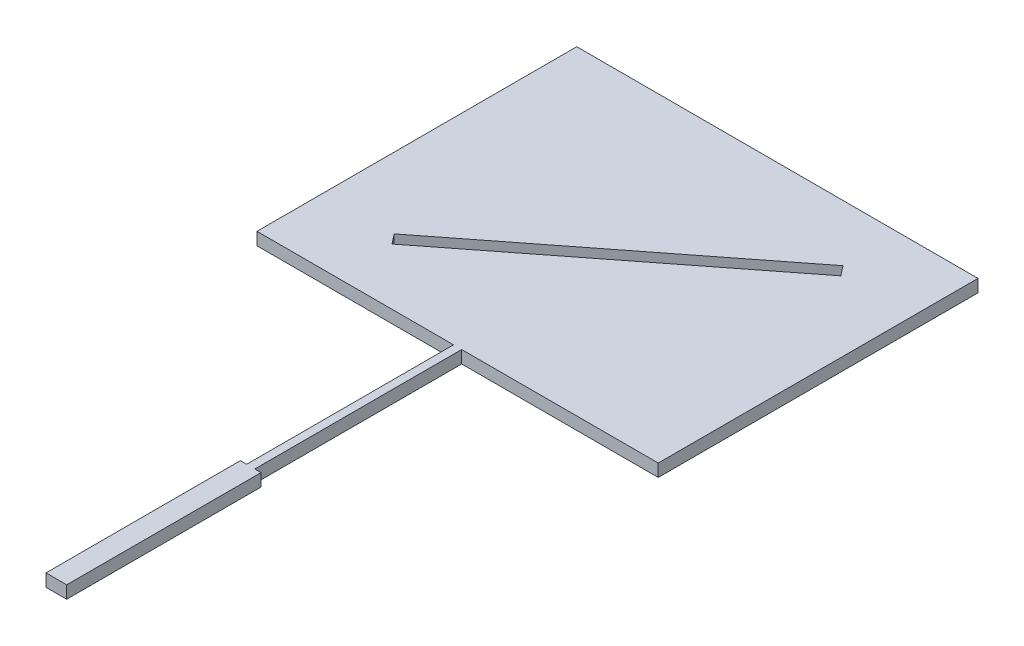
ISO-10303-21;
HEADER;
FILE_DESCRIPTION(('STEP AP214'),'2;1');
FILE_NAME('part.step','',(''),(''),'','','');
FILE_SCHEMA(('AUTOMOTIVE_DESIGN { 1 0 10303 214 1 1 1 1 }'));
ENDSEC;
DATA;
#1=APPLICATION_CONTEXT('core data for automotive mechanical design processes');
#2=APPLICATION_PROTOCOL_DEFINITION('international standard','automotive_design',2000,#1);
#3=PRODUCT_CONTEXT('',#1,'mechanical');
#4=PRODUCT('Part','Part','',(#3));
#5=PRODUCT_RELATED_PRODUCT_CATEGORY('part','',(#4));
#6=PRODUCT_DEFINITION_FORMATION('','',#4);
#7=PRODUCT_DEFINITION_CONTEXT('part definition',#1,'design');
#8=PRODUCT_DEFINITION('design','',#6,#7);
#9=PRODUCT_DEFINITION_SHAPE('','',#8);
#10=(LENGTH_UNIT() NAMED_UNIT(*) SI_UNIT(.MILLI.,.METRE.));
#11=(NAMED_UNIT(*) PLANE_ANGLE_UNIT() SI_UNIT($,.RADIAN.));
#12=(NAMED_UNIT(*) SI_UNIT($,.STERADIAN.) SOLID_ANGLE_UNIT());
#13=UNCERTAINTY_MEASURE_WITH_UNIT(LENGTH_MEASURE(1.E-05),#10,'distance_accuracy_value','');
#14=(GEOMETRIC_REPRESENTATION_CONTEXT(3) GLOBAL_UNCERTAINTY_ASSIGNED_CONTEXT((#13)) GLOBAL_UNIT_ASSIGNED_CONTEXT((#10,
#11,#12)) REPRESENTATION_CONTEXT('',''));
#15=CARTESIAN_POINT('',(0.,0.,0.));
#16=DIRECTION('',(0.,0.,1.));
#17=DIRECTION('',(1.,0.,0.));
#18=AXIS2_PLACEMENT_3D('',#15,#16,#17);
#19=CARTESIAN_POINT('',(0.,2.,-31.));
#20=DIRECTION('',(1.,0.,0.));
#21=DIRECTION('',(0.,0.,-1.));
#22=AXIS2_PLACEMENT_3D('',#19,#20,#21);
#23=PLANE('',#22);
#24=DIRECTION('',(0.,0.,1.));
#25=VECTOR('',#24,1.);
#26=CARTESIAN_POINT('',(0.,0.,-31.));
#27=LINE('',#26,#25);
#28=CARTESIAN_POINT('',(0.,0.,-31.));
#29=VERTEX_POINT('',#28);
#30=CARTESIAN_POINT('',(0.,0.,0.));
#31=VERTEX_POINT('',#30);
#32=EDGE_CURVE('E182',#29,#31,#27,.T.);
#33=ORIENTED_EDGE('',*,*,#32,.T.);
#34=DIRECTION('',(0.,-1.,0.));
#35=VECTOR('',#34,1.);
#36=CARTESIAN_POINT('',(0.,2.,0.));
#37=LINE('',#36,#35);
#38=CARTESIAN_POINT('',(0.,2.,0.));
#39=VERTEX_POINT('',#38);
#40=EDGE_CURVE('E11',#39,#31,#37,.T.);
#41=ORIENTED_EDGE('',*,*,#40,.F.);
#42=DIRECTION('',(0.,0.,1.));
#43=VECTOR('',#42,1.);
#44=CARTESIAN_POINT('',(0.,2.,-31.));
#45=LINE('',#44,#43);
#46=CARTESIAN_POINT('',(0.,2.,-31.));
#47=VERTEX_POINT('',#46);
#48=EDGE_CURVE('E186',#47,#39,#45,.T.);
#49=ORIENTED_EDGE('',*,*,#48,.F.);
#50=DIRECTION('',(0.,-1.,0.));
#51=VECTOR('',#50,1.);
#52=CARTESIAN_POINT('',(0.,2.,-31.));
#53=LINE('',#52,#51);
#54=EDGE_CURVE('E212',#47,#29,#53,.T.);
#55=ORIENTED_EDGE('',*,*,#54,.T.);
#56=EDGE_LOOP('',(#33,#41,#49,#55));
#57=FACE_BOUND('',#56,.T.);
#58=ADVANCED_FACE('F37',(#57),#23,.F.);
#59=CARTESIAN_POINT('',(0.,2.,0.));
#60=DIRECTION('',(0.,0.,-1.));
#61=DIRECTION('',(-1.,0.,0.));
#62=AXIS2_PLACEMENT_3D('',#59,#60,#61);
#63=PLANE('',#62);
#64=DIRECTION('',(1.,0.,0.));
#65=VECTOR('',#64,1.);
#66=CARTESIAN_POINT('',(0.,0.,0.));
#67=LINE('',#66,#65);
#68=CARTESIAN_POINT('',(3.3,0.,0.));
#69=VERTEX_POINT('',#68);
#70=EDGE_CURVE('E215',#31,#69,#67,.T.);
#71=ORIENTED_EDGE('',*,*,#70,.T.);
#72=DIRECTION('',(0.,-1.,0.));
#73=VECTOR('',#72,1.);
#74=CARTESIAN_POINT('',(3.3,2.,0.));
#75=LINE('',#74,#73);
#76=CARTESIAN_POINT('',(3.3,2.,0.));
#77=VERTEX_POINT('',#76);
#78=EDGE_CURVE('E44',#77,#69,#75,.T.);
#79=ORIENTED_EDGE('',*,*,#78,.F.);
#80=DIRECTION('',(1.,0.,0.));
#81=VECTOR('',#80,1.);
#82=CARTESIAN_POINT('',(0.,2.,0.));
#83=LINE('',#82,#81);
#84=EDGE_CURVE('E189',#39,#77,#83,.T.);
#85=ORIENTED_EDGE('',*,*,#84,.F.);
#86=ORIENTED_EDGE('',*,*,#40,.T.);
#87=EDGE_LOOP('',(#71,#79,#85,#86));
#88=FACE_BOUND('',#87,.T.);
#89=ADVANCED_FACE('F290',(#88),#63,.F.);
#90=CARTESIAN_POINT('',(3.3,2.,0.));
#91=DIRECTION('',(-1.,0.,0.));
#92=DIRECTION('',(0.,0.,1.));
#93=AXIS2_PLACEMENT_3D('',#90,#91,#92);
#94=PLANE('',#93);
#95=DIRECTION('',(0.,0.,-1.));
#96=VECTOR('',#95,1.);
#97=CARTESIAN_POINT('',(3.3,0.,0.));
#98=LINE('',#97,#96);
#99=CARTESIAN_POINT('',(3.3,0.,-31.));
#100=VERTEX_POINT('',#99);
#101=EDGE_CURVE('E217',#69,#100,#98,.T.);
#102=ORIENTED_EDGE('',*,*,#101,.T.);
#103=DIRECTION('',(0.,-1.,0.));
#104=VECTOR('',#103,1.);
#105=CARTESIAN_POINT('',(3.3,2.,-31.));
#106=LINE('',#105,#104);
#107=CARTESIAN_POINT('',(3.3,2.,-31.));
#108=VERTEX_POINT('',#107);
#109=EDGE_CURVE('E262',#108,#100,#106,.T.);
#110=ORIENTED_EDGE('',*,*,#109,.F.);
#111=DIRECTION('',(0.,0.,-1.));
#112=VECTOR('',#111,1.);
#113=CARTESIAN_POINT('',(3.3,2.,0.));
#114=LINE('',#113,#112);
#115=EDGE_CURVE('E192',#77,#108,#114,.T.);
#116=ORIENTED_EDGE('',*,*,#115,.F.);
#117=ORIENTED_EDGE('',*,*,#78,.T.);
#118=EDGE_LOOP('',(#102,#110,#116,#117));
#119=FACE_BOUND('',#118,.T.);
#120=ADVANCED_FACE('F269',(#119),#94,.F.);
#121=CARTESIAN_POINT('',(3.3,2.,-31.));
#122=DIRECTION('',(0.,0.,1.));
#123=DIRECTION('',(1.,0.,0.));
#124=AXIS2_PLACEMENT_3D('',#121,#122,#123);
#125=PLANE('',#124);
#126=DIRECTION('',(-1.,0.,0.));
#127=VECTOR('',#126,1.);
#128=CARTESIAN_POINT('',(3.3,0.,-31.));
#129=LINE('',#128,#127);
#130=CARTESIAN_POINT('',(2.3,0.,-31.));
#131=VERTEX_POINT('',#130);
#132=EDGE_CURVE('E219',#100,#131,#129,.T.);
#133=ORIENTED_EDGE('',*,*,#132,.T.);
#134=DIRECTION('',(0.,-1.,0.));
#135=VECTOR('',#134,1.);
#136=CARTESIAN_POINT('',(2.3,2.,-31.));
#137=LINE('',#136,#135);
#138=CARTESIAN_POINT('',(2.3,2.,-31.));
#139=VERTEX_POINT('',#138);
#140=EDGE_CURVE('E259',#139,#131,#137,.T.);
#141=ORIENTED_EDGE('',*,*,#140,.F.);
#142=DIRECTION('',(-1.,0.,0.));
#143=VECTOR('',#142,1.);
#144=CARTESIAN_POINT('',(3.3,2.,-31.));
#145=LINE('',#144,#143);
#146=EDGE_CURVE('E194',#108,#139,#145,.T.);
#147=ORIENTED_EDGE('',*,*,#146,.F.);
#148=ORIENTED_EDGE('',*,*,#109,.T.);
#149=EDGE_LOOP('',(#133,#141,#147,#148));
#150=FACE_BOUND('',#149,.T.);
#151=ADVANCED_FACE('F278',(#150),#125,.F.);
#152=CARTESIAN_POINT('',(2.3,2.,-31.));
#153=DIRECTION('',(-1.,0.,0.));
#154=DIRECTION('',(0.,0.,1.));
#155=AXIS2_PLACEMENT_3D('',#152,#153,#154);
#156=PLANE('',#155);
#157=DIRECTION('',(0.,0.,-1.));
#158=VECTOR('',#157,1.);
#159=CARTESIAN_POINT('',(2.3,0.,-31.));
#160=LINE('',#159,#158);
#161=CARTESIAN_POINT('',(2.3,0.,-64.));
#162=VERTEX_POINT('',#161);
#163=EDGE_CURVE('E221',#131,#162,#160,.T.);
#164=ORIENTED_EDGE('',*,*,#163,.T.);
#165=DIRECTION('',(0.,-1.,0.));
#166=VECTOR('',#165,1.);
#167=CARTESIAN_POINT('',(2.3,2.,-64.));
#168=LINE('',#167,#166);
#169=CARTESIAN_POINT('',(2.3,2.,-64.));
#170=VERTEX_POINT('',#169);
#171=EDGE_CURVE('E256',#170,#162,#168,.T.);
#172=ORIENTED_EDGE('',*,*,#171,.F.);
#173=DIRECTION('',(0.,0.,-1.));
#174=VECTOR('',#173,1.);
#175=CARTESIAN_POINT('',(2.3,2.,-31.));
#176=LINE('',#175,#174);
#177=EDGE_CURVE('E196',#139,#170,#176,.T.);
#178=ORIENTED_EDGE('',*,*,#177,.F.);
#179=ORIENTED_EDGE('',*,*,#140,.T.);
#180=EDGE_LOOP('',(#164,#172,#178,#179));
#181=FACE_BOUND('',#180,.T.);
#182=ADVANCED_FACE('F282',(#181),#156,.F.);
#183=CARTESIAN_POINT('',(2.3,2.,-64.));
#184=DIRECTION('',(0.,0.,-1.));
#185=DIRECTION('',(-1.,0.,0.));
#186=AXIS2_PLACEMENT_3D('',#183,#184,#185);
#187=PLANE('',#186);
#188=DIRECTION('',(1.,0.,0.));
#189=VECTOR('',#188,1.);
#190=CARTESIAN_POINT('',(2.3,0.,-64.));
#191=LINE('',#190,#189);
#192=CARTESIAN_POINT('',(33.65,0.,-64.));
#193=VERTEX_POINT('',#192);
#194=EDGE_CURVE('E223',#162,#193,#191,.T.);
#195=ORIENTED_EDGE('',*,*,#194,.T.);
#196=DIRECTION('',(0.,-1.,0.));
#197=VECTOR('',#196,1.);
#198=CARTESIAN_POINT('',(33.65,2.,-64.));
#199=LINE('',#198,#197);
#200=CARTESIAN_POINT('',(33.65,2.,-64.));
#201=VERTEX_POINT('',#200);
#202=EDGE_CURVE('E253',#201,#193,#199,.T.);
#203=ORIENTED_EDGE('',*,*,#202,.F.);
#204=DIRECTION('',(1.,0.,0.));
#205=VECTOR('',#204,1.);
#206=CARTESIAN_POINT('',(2.3,2.,-64.));
#207=LINE('',#206,#205);
#208=EDGE_CURVE('E198',#170,#201,#207,.T.);
#209=ORIENTED_EDGE('',*,*,#208,.F.);
#210=ORIENTED_EDGE('',*,*,#171,.T.);
#211=EDGE_LOOP('',(#195,#203,#209,#210));
#212=FACE_BOUND('',#211,.T.);
#213=ADVANCED_FACE('F323',(#212),#187,.F.);
#214=CARTESIAN_POINT('',(33.65,2.,-64.));
#215=DIRECTION('',(-1.,0.,0.));
#216=DIRECTION('',(0.,0.,1.));
#217=AXIS2_PLACEMENT_3D('',#214,#215,#216);
#218=PLANE('',#217);
#219=DIRECTION('',(0.,0.,-1.));
#220=VECTOR('',#219,1.);
#221=CARTESIAN_POINT('',(33.65,0.,-64.));
#222=LINE('',#221,#220);
#223=CARTESIAN_POINT('',(33.65,0.,-115.));
#224=VERTEX_POINT('',#223);
#225=EDGE_CURVE('E225',#193,#224,#222,.T.);
#226=ORIENTED_EDGE('',*,*,#225,.T.);
#227=DIRECTION('',(0.,-1.,0.));
#228=VECTOR('',#227,1.);
#229=CARTESIAN_POINT('',(33.65,2.,-115.));
#230=LINE('',#229,#228);
#231=CARTESIAN_POINT('',(33.65,2.,-115.));
#232=VERTEX_POINT('',#231);
#233=EDGE_CURVE('E250',#232,#224,#230,.T.);
#234=ORIENTED_EDGE('',*,*,#233,.F.);
#235=DIRECTION('',(0.,0.,-1.));
#236=VECTOR('',#235,1.);
#237=CARTESIAN_POINT('',(33.65,2.,-64.));
#238=LINE('',#237,#236);
#239=EDGE_CURVE('E200',#201,#232,#238,.T.);
#240=ORIENTED_EDGE('',*,*,#239,.F.);
#241=ORIENTED_EDGE('',*,*,#202,.T.);
#242=EDGE_LOOP('',(#226,#234,#240,#241));
#243=FACE_BOUND('',#242,.T.);
#244=ADVANCED_FACE('F321',(#243),#218,.F.);
#245=CARTESIAN_POINT('',(33.65,2.,-115.));
#246=DIRECTION('',(0.,0.,1.));
#247=DIRECTION('',(1.,0.,0.));
#248=AXIS2_PLACEMENT_3D('',#245,#246,#247);
#249=PLANE('',#248);
#250=DIRECTION('',(-1.,0.,0.));
#251=VECTOR('',#250,1.);
#252=CARTESIAN_POINT('',(33.65,0.,-115.));
#253=LINE('',#252,#251);
#254=CARTESIAN_POINT('',(-30.35,0.,-115.));
#255=VERTEX_POINT('',#254);
#256=EDGE_CURVE('E227',#224,#255,#253,.T.);
#257=ORIENTED_EDGE('',*,*,#256,.T.);
#258=DIRECTION('',(0.,-1.,0.));
#259=VECTOR('',#258,1.);
#260=CARTESIAN_POINT('',(-30.35,2.,-115.));
#261=LINE('',#260,#259);
#262=CARTESIAN_POINT('',(-30.35,2.,-115.));
#263=VERTEX_POINT('',#262);
#264=EDGE_CURVE('E247',#263,#255,#261,.T.);
#265=ORIENTED_EDGE('',*,*,#264,.F.);
#266=DIRECTION('',(-1.,0.,0.));
#267=VECTOR('',#266,1.);
#268=CARTESIAN_POINT('',(33.65,2.,-115.));
#269=LINE('',#268,#267);
#270=EDGE_CURVE('E202',#232,#263,#269,.T.);
#271=ORIENTED_EDGE('',*,*,#270,.F.);
#272=ORIENTED_EDGE('',*,*,#233,.T.);
#273=EDGE_LOOP('',(#257,#265,#271,#272));
#274=FACE_BOUND('',#273,.T.);
#275=ADVANCED_FACE('F317',(#274),#249,.F.);
#276=CARTESIAN_POINT('',(-30.35,2.,-115.));
#277=DIRECTION('',(1.,0.,0.));
#278=DIRECTION('',(0.,0.,-1.));
#279=AXIS2_PLACEMENT_3D('',#276,#277,#278);
#280=PLANE('',#279);
#281=DIRECTION('',(0.,0.,1.));
#282=VECTOR('',#281,1.);
#283=CARTESIAN_POINT('',(-30.35,0.,-115.));
#284=LINE('',#283,#282);
#285=CARTESIAN_POINT('',(-30.35,0.,-64.));
#286=VERTEX_POINT('',#285);
#287=EDGE_CURVE('E229',#255,#286,#284,.T.);
#288=ORIENTED_EDGE('',*,*,#287,.T.);
#289=DIRECTION('',(0.,-1.,0.));
#290=VECTOR('',#289,1.);
#291=CARTESIAN_POINT('',(-30.35,2.,-64.));
#292=LINE('',#291,#290);
#293=CARTESIAN_POINT('',(-30.35,2.,-64.));
#294=VERTEX_POINT('',#293);
#295=EDGE_CURVE('E244',#294,#286,#292,.T.);
#296=ORIENTED_EDGE('',*,*,#295,.F.);
#297=DIRECTION('',(0.,0.,1.));
#298=VECTOR('',#297,1.);
#299=CARTESIAN_POINT('',(-30.35,2.,-115.));
#300=LINE('',#299,#298);
#301=EDGE_CURVE('E204',#263,#294,#300,.T.);
#302=ORIENTED_EDGE('',*,*,#301,.F.);
#303=ORIENTED_EDGE('',*,*,#264,.T.);
#304=EDGE_LOOP('',(#288,#296,#302,#303));
#305=FACE_BOUND('',#304,.T.);
#306=ADVANCED_FACE('F312',(#305),#280,.F.);
#307=CARTESIAN_POINT('',(-30.35,2.,-64.));
#308=DIRECTION('',(0.,0.,-1.));
#309=DIRECTION('',(-1.,0.,0.));
#310=AXIS2_PLACEMENT_3D('',#307,#308,#309);
#311=PLANE('',#310);
#312=DIRECTION('',(1.,0.,0.));
#313=VECTOR('',#312,1.);
#314=CARTESIAN_POINT('',(-30.35,0.,-64.));
#315=LINE('',#314,#313);
#316=CARTESIAN_POINT('',(1.,0.,-64.));
#317=VERTEX_POINT('',#316);
#318=EDGE_CURVE('E231',#286,#317,#315,.T.);
#319=ORIENTED_EDGE('',*,*,#318,.T.);
#320=DIRECTION('',(0.,-1.,0.));
#321=VECTOR('',#320,1.);
#322=CARTESIAN_POINT('',(1.,2.,-64.));
#323=LINE('',#322,#321);
#324=CARTESIAN_POINT('',(1.,2.,-64.));
#325=VERTEX_POINT('',#324);
#326=EDGE_CURVE('E241',#325,#317,#323,.T.);
#327=ORIENTED_EDGE('',*,*,#326,.F.);
#328=DIRECTION('',(1.,0.,0.));
#329=VECTOR('',#328,1.);
#330=CARTESIAN_POINT('',(-30.35,2.,-64.));
#331=LINE('',#330,#329);
#332=EDGE_CURVE('E206',#294,#325,#331,.T.);
#333=ORIENTED_EDGE('',*,*,#332,.F.);
#334=ORIENTED_EDGE('',*,*,#295,.T.);
#335=EDGE_LOOP('',(#319,#327,#333,#334));
#336=FACE_BOUND('',#335,.T.);
#337=ADVANCED_FACE('F306',(#336),#311,.F.);
#338=CARTESIAN_POINT('',(1.,2.,-64.));
#339=DIRECTION('',(1.,0.,0.));
#340=DIRECTION('',(0.,0.,-1.));
#341=AXIS2_PLACEMENT_3D('',#338,#339,#340);
#342=PLANE('',#341);
#343=DIRECTION('',(0.,0.,1.));
#344=VECTOR('',#343,1.);
#345=CARTESIAN_POINT('',(1.,0.,-64.));
#346=LINE('',#345,#344);
#347=CARTESIAN_POINT('',(1.,0.,-31.));
#348=VERTEX_POINT('',#347);
#349=EDGE_CURVE('E233',#317,#348,#346,.T.);
#350=ORIENTED_EDGE('',*,*,#349,.T.);
#351=DIRECTION('',(0.,-1.,0.));
#352=VECTOR('',#351,1.);
#353=CARTESIAN_POINT('',(1.,2.,-31.));
#354=LINE('',#353,#352);
#355=CARTESIAN_POINT('',(1.,2.,-31.));
#356=VERTEX_POINT('',#355);
#357=EDGE_CURVE('E238',#356,#348,#354,.T.);
#358=ORIENTED_EDGE('',*,*,#357,.F.);
#359=DIRECTION('',(0.,0.,1.));
#360=VECTOR('',#359,1.);
#361=CARTESIAN_POINT('',(1.,2.,-64.));
#362=LINE('',#361,#360);
#363=EDGE_CURVE('E208',#325,#356,#362,.T.);
#364=ORIENTED_EDGE('',*,*,#363,.F.);
#365=ORIENTED_EDGE('',*,*,#326,.T.);
#366=EDGE_LOOP('',(#350,#358,#364,#365));
#367=FACE_BOUND('',#366,.T.);
#368=ADVANCED_FACE('F302',(#367),#342,.F.);
#369=CARTESIAN_POINT('',(1.,2.,-31.));
#370=DIRECTION('',(0.,0.,1.));
#371=DIRECTION('',(1.,0.,0.));
#372=AXIS2_PLACEMENT_3D('',#369,#370,#371);
#373=PLANE('',#372);
#374=DIRECTION('',(-1.,0.,0.));
#375=VECTOR('',#374,1.);
#376=CARTESIAN_POINT('',(1.,0.,-31.));
#377=LINE('',#376,#375);
#378=EDGE_CURVE('E190',#348,#29,#377,.T.);
#379=ORIENTED_EDGE('',*,*,#378,.T.);
#380=ORIENTED_EDGE('',*,*,#54,.F.);
#381=DIRECTION('',(-1.,0.,0.));
#382=VECTOR('',#381,1.);
#383=CARTESIAN_POINT('',(1.,2.,-31.));
#384=LINE('',#383,#382);
#385=EDGE_CURVE('E210',#356,#47,#384,.T.);
#386=ORIENTED_EDGE('',*,*,#385,.F.);
#387=ORIENTED_EDGE('',*,*,#357,.T.);
#388=EDGE_LOOP('',(#379,#380,#386,#387));
#389=FACE_BOUND('',#388,.T.);
#390=ADVANCED_FACE('F297',(#389),#373,.F.);
#391=CARTESIAN_POINT('',(0.,2.,0.));
#392=DIRECTION('',(0.,1.,0.));
#393=DIRECTION('',(0.,0.,1.));
#394=AXIS2_PLACEMENT_3D('',#391,#392,#393);
#395=PLANE('',#394);
#396=DIRECTION('',(-0.615661475325648,0.,-0.78801075360673));
#397=VECTOR('',#396,1.);
#398=CARTESIAN_POINT('',(21.7442742169714,2.,-105.199367620804));
#399=LINE('',#398,#397);
#400=CARTESIAN_POINT('',(22.3599356922971,2.,-104.411356867198));
#401=VERTEX_POINT('',#400);
#402=CARTESIAN_POINT('',(21.1286127416458,2.,-105.987378374411));
#403=VERTEX_POINT('',#402);
#404=EDGE_CURVE('E153',#401,#403,#399,.T.);
#405=ORIENTED_EDGE('',*,*,#404,.F.);
#406=DIRECTION('',(0.788010753606721,0.,-0.615661475325659));
#407=VECTOR('',#406,1.);
#408=CARTESIAN_POINT('',(22.3599356922971,2.,-104.411356867198));
#409=LINE('',#408,#407);
#410=CARTESIAN_POINT('',(-17.8286127416457,2.,-73.012621625589));
#411=VERTEX_POINT('',#410);
#412=EDGE_CURVE('E168',#411,#401,#409,.T.);
#413=ORIENTED_EDGE('',*,*,#412,.F.);
#414=DIRECTION('',(0.615661475325667,0.,0.788010753606716));
#415=VECTOR('',#414,1.);
#416=CARTESIAN_POINT('',(-17.8286127416457,2.,-73.012621625589));
#417=LINE('',#416,#415);
#418=CARTESIAN_POINT('',(-19.059935692297,2.,-74.5886431328024));
#419=VERTEX_POINT('',#418);
#420=EDGE_CURVE('E175',#419,#411,#417,.T.);
#421=ORIENTED_EDGE('',*,*,#420,.F.);
#422=DIRECTION('',(-0.788010753606721,0.,0.61566147532566));
#423=VECTOR('',#422,1.);
#424=CARTESIAN_POINT('',(-19.059935692297,2.,-74.5886431328024));
#425=LINE('',#424,#423);
#426=EDGE_CURVE('E173',#403,#419,#425,.T.);
#427=ORIENTED_EDGE('',*,*,#426,.F.);
#428=EDGE_LOOP('',(#405,#413,#421,#427));
#429=FACE_BOUND('',#428,.T.);
#430=ORIENTED_EDGE('',*,*,#48,.T.);
#431=ORIENTED_EDGE('',*,*,#84,.T.);
#432=ORIENTED_EDGE('',*,*,#115,.T.);
#433=ORIENTED_EDGE('',*,*,#146,.T.);
#434=ORIENTED_EDGE('',*,*,#177,.T.);
#435=ORIENTED_EDGE('',*,*,#208,.T.);
#436=ORIENTED_EDGE('',*,*,#239,.T.);
#437=ORIENTED_EDGE('',*,*,#270,.T.);
#438=ORIENTED_EDGE('',*,*,#301,.T.);
#439=ORIENTED_EDGE('',*,*,#332,.T.);
#440=ORIENTED_EDGE('',*,*,#363,.T.);
#441=ORIENTED_EDGE('',*,*,#385,.T.);
#442=EDGE_LOOP('',(#430,#431,#432,#433,#434,#435,#436,#437,#438,#439,#440,#441));
#443=FACE_BOUND('',#442,.T.);
#444=ADVANCED_FACE('F286',(#429,#443),#395,.T.);
#445=CARTESIAN_POINT('',(0.,0.,0.));
#446=DIRECTION('',(0.,1.,0.));
#447=DIRECTION('',(0.,0.,1.));
#448=AXIS2_PLACEMENT_3D('',#445,#446,#447);
#449=PLANE('',#448);
#450=DIRECTION('',(0.788010753606721,0.,-0.615661475325659));
#451=VECTOR('',#450,1.);
#452=CARTESIAN_POINT('',(22.3599356922971,0.,-104.411356867198));
#453=LINE('',#452,#451);
#454=CARTESIAN_POINT('',(-17.8286127416457,0.,-73.012621625589));
#455=VERTEX_POINT('',#454);
#456=CARTESIAN_POINT('',(22.3599356922971,0.,-104.411356867198));
#457=VERTEX_POINT('',#456);
#458=EDGE_CURVE('E156',#455,#457,#453,.T.);
#459=ORIENTED_EDGE('',*,*,#458,.T.);
#460=DIRECTION('',(-0.615661475325659,0.,-0.788010753606722));
#461=VECTOR('',#460,1.);
#462=CARTESIAN_POINT('',(21.1286127416458,0.,-105.987378374411));
#463=LINE('',#462,#461);
#464=CARTESIAN_POINT('',(21.1286127416458,0.,-105.987378374411));
#465=VERTEX_POINT('',#464);
#466=EDGE_CURVE('E150',#457,#465,#463,.T.);
#467=ORIENTED_EDGE('',*,*,#466,.T.);
#468=DIRECTION('',(-0.788010753606721,0.,0.61566147532566));
#469=VECTOR('',#468,1.);
#470=CARTESIAN_POINT('',(-19.059935692297,0.,-74.5886431328024));
#471=LINE('',#470,#469);
#472=CARTESIAN_POINT('',(-19.059935692297,0.,-74.5886431328024));
#473=VERTEX_POINT('',#472);
#474=EDGE_CURVE('E159',#465,#473,#471,.T.);
#475=ORIENTED_EDGE('',*,*,#474,.T.);
#476=DIRECTION('',(0.615661475325667,0.,0.788010753606716));
#477=VECTOR('',#476,1.);
#478=CARTESIAN_POINT('',(-17.8286127416457,0.,-73.012621625589));
#479=LINE('',#478,#477);
#480=EDGE_CURVE('E59',#473,#455,#479,.T.);
#481=ORIENTED_EDGE('',*,*,#480,.T.);
#482=EDGE_LOOP('',(#459,#467,#475,#481));
#483=FACE_BOUND('',#482,.T.);
#484=ORIENTED_EDGE('',*,*,#32,.F.);
#485=ORIENTED_EDGE('',*,*,#378,.F.);
#486=ORIENTED_EDGE('',*,*,#349,.F.);
#487=ORIENTED_EDGE('',*,*,#318,.F.);
#488=ORIENTED_EDGE('',*,*,#287,.F.);
#489=ORIENTED_EDGE('',*,*,#256,.F.);
#490=ORIENTED_EDGE('',*,*,#225,.F.);
#491=ORIENTED_EDGE('',*,*,#194,.F.);
#492=ORIENTED_EDGE('',*,*,#163,.F.);
#493=ORIENTED_EDGE('',*,*,#132,.F.);
#494=ORIENTED_EDGE('',*,*,#101,.F.);
#495=ORIENTED_EDGE('',*,*,#70,.F.);
#496=EDGE_LOOP('',(#484,#485,#486,#487,#488,#489,#490,#491,#492,#493,#494,#495));
#497=FACE_BOUND('',#496,.T.);
#498=ADVANCED_FACE('F164',(#483,#497),#449,.F.);
#499=CARTESIAN_POINT('',(21.7442742169714,0.,-105.199367620804));
#500=DIRECTION('',(0.78801075360673,0.,-0.615661475325648));
#501=DIRECTION('',(-0.615661475325648,0.,-0.78801075360673));
#502=AXIS2_PLACEMENT_3D('',#499,#500,#501);
#503=PLANE('',#502);
#504=ORIENTED_EDGE('',*,*,#404,.T.);
#505=DIRECTION('',(0.,1.,0.));
#506=VECTOR('',#505,1.);
#507=CARTESIAN_POINT('',(21.1286127416458,0.,-105.987378374411));
#508=LINE('',#507,#506);
#509=EDGE_CURVE('E51',#465,#403,#508,.T.);
#510=ORIENTED_EDGE('',*,*,#509,.F.);
#511=ORIENTED_EDGE('',*,*,#466,.F.);
#512=DIRECTION('',(0.,1.,0.));
#513=VECTOR('',#512,1.);
#514=CARTESIAN_POINT('',(22.3599356922971,0.,-104.411356867198));
#515=LINE('',#514,#513);
#516=EDGE_CURVE('E180',#457,#401,#515,.T.);
#517=ORIENTED_EDGE('',*,*,#516,.T.);
#518=EDGE_LOOP('',(#504,#510,#511,#517));
#519=FACE_BOUND('',#518,.T.);
#520=ADVANCED_FACE('F148',(#519),#503,.F.);
#521=CARTESIAN_POINT('',(22.3599356922971,0.,-104.411356867198));
#522=DIRECTION('',(0.61566147532566,0.,0.788010753606721));
#523=DIRECTION('',(0.788010753606721,0.,-0.61566147532566));
#524=AXIS2_PLACEMENT_3D('',#521,#522,#523);
#525=PLANE('',#524);
#526=ORIENTED_EDGE('',*,*,#412,.T.);
#527=ORIENTED_EDGE('',*,*,#516,.F.);
#528=ORIENTED_EDGE('',*,*,#458,.F.);
#529=DIRECTION('',(0.,1.,0.));
#530=VECTOR('',#529,1.);
#531=CARTESIAN_POINT('',(-17.8286127416457,0.,-73.012621625589));
#532=LINE('',#531,#530);
#533=EDGE_CURVE('E183',#455,#411,#532,.T.);
#534=ORIENTED_EDGE('',*,*,#533,.T.);
#535=EDGE_LOOP('',(#526,#527,#528,#534));
#536=FACE_BOUND('',#535,.T.);
#537=ADVANCED_FACE('F430',(#536),#525,.F.);
#538=CARTESIAN_POINT('',(-17.8286127416457,0.,-73.012621625589));
#539=DIRECTION('',(-0.788010753606716,0.,0.615661475325667));
#540=DIRECTION('',(0.615661475325667,0.,0.788010753606716));
#541=AXIS2_PLACEMENT_3D('',#538,#539,#540);
#542=PLANE('',#541);
#543=ORIENTED_EDGE('',*,*,#420,.T.);
#544=ORIENTED_EDGE('',*,*,#533,.F.);
#545=ORIENTED_EDGE('',*,*,#480,.F.);
#546=DIRECTION('',(0.,1.,0.));
#547=VECTOR('',#546,1.);
#548=CARTESIAN_POINT('',(-19.059935692297,0.,-74.5886431328024));
#549=LINE('',#548,#547);
#550=EDGE_CURVE('E155',#473,#419,#549,.T.);
#551=ORIENTED_EDGE('',*,*,#550,.T.);
#552=EDGE_LOOP('',(#543,#544,#545,#551));
#553=FACE_BOUND('',#552,.T.);
#554=ADVANCED_FACE('F440',(#553),#542,.F.);
#555=CARTESIAN_POINT('',(-19.059935692297,0.,-74.5886431328024));
#556=DIRECTION('',(-0.61566147532566,0.,-0.788010753606721));
#557=DIRECTION('',(-0.788010753606721,0.,0.61566147532566));
#558=AXIS2_PLACEMENT_3D('',#555,#556,#557);
#559=PLANE('',#558);
#560=ORIENTED_EDGE('',*,*,#426,.T.);
#561=ORIENTED_EDGE('',*,*,#550,.F.);
#562=ORIENTED_EDGE('',*,*,#474,.F.);
#563=ORIENTED_EDGE('',*,*,#509,.T.);
#564=EDGE_LOOP('',(#560,#561,#562,#563));
#565=FACE_BOUND('',#564,.T.);
#566=ADVANCED_FACE('F160',(#565),#559,.F.);
#567=CLOSED_SHELL('',(#58,#89,#120,#151,#182,#213,#244,#275,#306,#337,#368,#390,#444,#498,#520,
#537,#554,#566));
#568=MANIFOLD_SOLID_BREP('B2',#567);
#569=ADVANCED_BREP_SHAPE_REPRESENTATION('',(#18,#568),#14);
#570=SHAPE_DEFINITION_REPRESENTATION(#9,#569);
ENDSEC;
END-ISO-10303-21;
